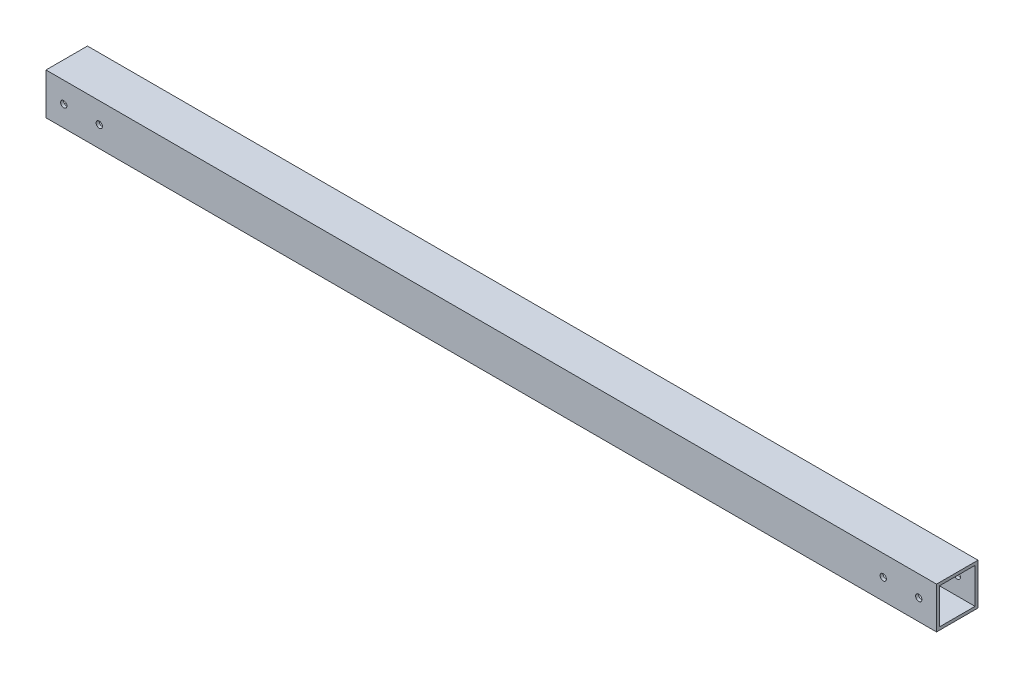
ISO-10303-21;
HEADER;
FILE_DESCRIPTION(('STEP AP214'),'2;1');
FILE_NAME('part.step','',(''),(''),'','','');
FILE_SCHEMA(('AUTOMOTIVE_DESIGN { 1 0 10303 214 1 1 1 1 }'));
ENDSEC;
DATA;
#1=APPLICATION_CONTEXT('core data for automotive mechanical design processes');
#2=APPLICATION_PROTOCOL_DEFINITION('international standard','automotive_design',2000,#1);
#3=PRODUCT_CONTEXT('',#1,'mechanical');
#4=PRODUCT('Part','Part','',(#3));
#5=PRODUCT_RELATED_PRODUCT_CATEGORY('part','',(#4));
#6=PRODUCT_DEFINITION_FORMATION('','',#4);
#7=PRODUCT_DEFINITION_CONTEXT('part definition',#1,'design');
#8=PRODUCT_DEFINITION('design','',#6,#7);
#9=PRODUCT_DEFINITION_SHAPE('','',#8);
#10=(LENGTH_UNIT() NAMED_UNIT(*) SI_UNIT(.MILLI.,.METRE.));
#11=(NAMED_UNIT(*) PLANE_ANGLE_UNIT() SI_UNIT($,.RADIAN.));
#12=(NAMED_UNIT(*) SI_UNIT($,.STERADIAN.) SOLID_ANGLE_UNIT());
#13=UNCERTAINTY_MEASURE_WITH_UNIT(LENGTH_MEASURE(1.E-05),#10,'distance_accuracy_value','');
#14=(GEOMETRIC_REPRESENTATION_CONTEXT(3) GLOBAL_UNCERTAINTY_ASSIGNED_CONTEXT((#13)) GLOBAL_UNIT_ASSIGNED_CONTEXT((#10,
#11,#12)) REPRESENTATION_CONTEXT('',''));
#15=CARTESIAN_POINT('',(0.,0.,0.));
#16=DIRECTION('',(0.,0.,1.));
#17=DIRECTION('',(1.,0.,0.));
#18=AXIS2_PLACEMENT_3D('',#15,#16,#17);
#19=CARTESIAN_POINT('',(954.786,0.,0.));
#20=DIRECTION('',(-1.,0.,0.));
#21=DIRECTION('',(0.,0.,1.));
#22=AXIS2_PLACEMENT_3D('',#19,#20,#21);
#23=PLANE('',#22);
#24=DIRECTION('',(0.,-1.,0.));
#25=VECTOR('',#24,1.);
#26=CARTESIAN_POINT('',(954.786,0.,0.));
#27=LINE('',#26,#25);
#28=CARTESIAN_POINT('',(954.786,44.45,0.));
#29=VERTEX_POINT('',#28);
#30=CARTESIAN_POINT('',(954.786,0.,0.));
#31=VERTEX_POINT('',#30);
#32=EDGE_CURVE('E137',#29,#31,#27,.T.);
#33=ORIENTED_EDGE('',*,*,#32,.T.);
#34=DIRECTION('',(0.,0.,-1.));
#35=VECTOR('',#34,1.);
#36=CARTESIAN_POINT('',(954.786,0.,0.));
#37=LINE('',#36,#35);
#38=CARTESIAN_POINT('',(954.786,0.,-44.45));
#39=VERTEX_POINT('',#38);
#40=EDGE_CURVE('E140',#31,#39,#37,.T.);
#41=ORIENTED_EDGE('',*,*,#40,.T.);
#42=DIRECTION('',(0.,1.,0.));
#43=VECTOR('',#42,1.);
#44=CARTESIAN_POINT('',(954.786,0.,-44.45));
#45=LINE('',#44,#43);
#46=CARTESIAN_POINT('',(954.786,44.45,-44.45));
#47=VERTEX_POINT('',#46);
#48=EDGE_CURVE('E143',#39,#47,#45,.T.);
#49=ORIENTED_EDGE('',*,*,#48,.T.);
#50=DIRECTION('',(0.,0.,1.));
#51=VECTOR('',#50,1.);
#52=CARTESIAN_POINT('',(954.786,44.45,0.));
#53=LINE('',#52,#51);
#54=EDGE_CURVE('E145',#47,#29,#53,.T.);
#55=ORIENTED_EDGE('',*,*,#54,.T.);
#56=EDGE_LOOP('',(#33,#41,#49,#55));
#57=FACE_BOUND('',#56,.T.);
#58=DIRECTION('',(0.,0.,-1.));
#59=VECTOR('',#58,1.);
#60=CARTESIAN_POINT('',(954.786,3.175,-3.175));
#61=LINE('',#60,#59);
#62=CARTESIAN_POINT('',(954.786,3.175,-3.175));
#63=VERTEX_POINT('',#62);
#64=CARTESIAN_POINT('',(954.786,3.175,-41.275));
#65=VERTEX_POINT('',#64);
#66=EDGE_CURVE('E99',#63,#65,#61,.T.);
#67=ORIENTED_EDGE('',*,*,#66,.F.);
#68=DIRECTION('',(0.,-1.,0.));
#69=VECTOR('',#68,1.);
#70=CARTESIAN_POINT('',(954.786,3.175,-3.175));
#71=LINE('',#70,#69);
#72=CARTESIAN_POINT('',(954.786,41.275,-3.175));
#73=VERTEX_POINT('',#72);
#74=EDGE_CURVE('E121',#73,#63,#71,.T.);
#75=ORIENTED_EDGE('',*,*,#74,.F.);
#76=DIRECTION('',(0.,0.,1.));
#77=VECTOR('',#76,1.);
#78=CARTESIAN_POINT('',(954.786,41.275,-3.175));
#79=LINE('',#78,#77);
#80=CARTESIAN_POINT('',(954.786,41.275,-41.275));
#81=VERTEX_POINT('',#80);
#82=EDGE_CURVE('E119',#81,#73,#79,.T.);
#83=ORIENTED_EDGE('',*,*,#82,.F.);
#84=DIRECTION('',(0.,1.,0.));
#85=VECTOR('',#84,1.);
#86=CARTESIAN_POINT('',(954.786,3.175,-41.275));
#87=LINE('',#86,#85);
#88=EDGE_CURVE('E107',#65,#81,#87,.T.);
#89=ORIENTED_EDGE('',*,*,#88,.F.);
#90=EDGE_LOOP('',(#67,#75,#83,#89));
#91=FACE_BOUND('',#90,.T.);
#92=ADVANCED_FACE('F33',(#57,#91),#23,.F.);
#93=CARTESIAN_POINT('',(0.,0.,0.));
#94=DIRECTION('',(-1.,0.,0.));
#95=DIRECTION('',(0.,0.,1.));
#96=AXIS2_PLACEMENT_3D('',#93,#94,#95);
#97=PLANE('',#96);
#98=DIRECTION('',(0.,-1.,0.));
#99=VECTOR('',#98,1.);
#100=CARTESIAN_POINT('',(0.,0.,0.));
#101=LINE('',#100,#99);
#102=CARTESIAN_POINT('',(0.,44.45,0.));
#103=VERTEX_POINT('',#102);
#104=CARTESIAN_POINT('',(0.,0.,0.));
#105=VERTEX_POINT('',#104);
#106=EDGE_CURVE('E115',#103,#105,#101,.T.);
#107=ORIENTED_EDGE('',*,*,#106,.F.);
#108=DIRECTION('',(0.,0.,1.));
#109=VECTOR('',#108,1.);
#110=CARTESIAN_POINT('',(0.,44.45,0.));
#111=LINE('',#110,#109);
#112=CARTESIAN_POINT('',(0.,44.45,-44.45));
#113=VERTEX_POINT('',#112);
#114=EDGE_CURVE('E141',#113,#103,#111,.T.);
#115=ORIENTED_EDGE('',*,*,#114,.F.);
#116=DIRECTION('',(0.,1.,0.));
#117=VECTOR('',#116,1.);
#118=CARTESIAN_POINT('',(0.,0.,-44.45));
#119=LINE('',#118,#117);
#120=CARTESIAN_POINT('',(0.,0.,-44.45));
#121=VERTEX_POINT('',#120);
#122=EDGE_CURVE('E152',#121,#113,#119,.T.);
#123=ORIENTED_EDGE('',*,*,#122,.F.);
#124=DIRECTION('',(0.,0.,-1.));
#125=VECTOR('',#124,1.);
#126=CARTESIAN_POINT('',(0.,0.,0.));
#127=LINE('',#126,#125);
#128=EDGE_CURVE('E150',#105,#121,#127,.T.);
#129=ORIENTED_EDGE('',*,*,#128,.F.);
#130=EDGE_LOOP('',(#107,#115,#123,#129));
#131=FACE_BOUND('',#130,.T.);
#132=DIRECTION('',(0.,-1.,0.));
#133=VECTOR('',#132,1.);
#134=CARTESIAN_POINT('',(0.,3.175,-3.175));
#135=LINE('',#134,#133);
#136=CARTESIAN_POINT('',(0.,41.275,-3.175));
#137=VERTEX_POINT('',#136);
#138=CARTESIAN_POINT('',(0.,3.175,-3.175));
#139=VERTEX_POINT('',#138);
#140=EDGE_CURVE('E108',#137,#139,#135,.T.);
#141=ORIENTED_EDGE('',*,*,#140,.T.);
#142=DIRECTION('',(0.,0.,-1.));
#143=VECTOR('',#142,1.);
#144=CARTESIAN_POINT('',(0.,3.175,-3.175));
#145=LINE('',#144,#143);
#146=CARTESIAN_POINT('',(0.,3.175,-41.275));
#147=VERTEX_POINT('',#146);
#148=EDGE_CURVE('E57',#139,#147,#145,.T.);
#149=ORIENTED_EDGE('',*,*,#148,.T.);
#150=DIRECTION('',(0.,1.,0.));
#151=VECTOR('',#150,1.);
#152=CARTESIAN_POINT('',(0.,3.175,-41.275));
#153=LINE('',#152,#151);
#154=CARTESIAN_POINT('',(0.,41.275,-41.275));
#155=VERTEX_POINT('',#154);
#156=EDGE_CURVE('E114',#147,#155,#153,.T.);
#157=ORIENTED_EDGE('',*,*,#156,.T.);
#158=DIRECTION('',(0.,0.,1.));
#159=VECTOR('',#158,1.);
#160=CARTESIAN_POINT('',(0.,41.275,-3.175));
#161=LINE('',#160,#159);
#162=EDGE_CURVE('E129',#155,#137,#161,.T.);
#163=ORIENTED_EDGE('',*,*,#162,.T.);
#164=EDGE_LOOP('',(#141,#149,#157,#163));
#165=FACE_BOUND('',#164,.T.);
#166=ADVANCED_FACE('F171',(#131,#165),#97,.T.);
#167=CARTESIAN_POINT('',(954.786,0.,0.));
#168=DIRECTION('',(0.,0.,-1.));
#169=DIRECTION('',(-1.,0.,0.));
#170=AXIS2_PLACEMENT_3D('',#167,#168,#169);
#171=PLANE('',#170);
#172=CARTESIAN_POINT('',(19.05,22.225,0.));
#173=DIRECTION('',(0.,0.,1.));
#174=DIRECTION('',(1.,0.,0.));
#175=AXIS2_PLACEMENT_3D('',#172,#173,#174);
#176=CIRCLE('',#175,3.37819999999999);
#177=CARTESIAN_POINT('',(22.4282,22.225,0.));
#178=VERTEX_POINT('',#177);
#179=EDGE_CURVE('E250',#178,#178,#176,.T.);
#180=ORIENTED_EDGE('',*,*,#179,.F.);
#181=EDGE_LOOP('',(#180));
#182=FACE_BOUND('',#181,.T.);
#183=CARTESIAN_POINT('',(57.15,22.225,0.));
#184=DIRECTION('',(0.,0.,1.));
#185=DIRECTION('',(1.,0.,0.));
#186=AXIS2_PLACEMENT_3D('',#183,#184,#185);
#187=CIRCLE('',#186,3.3782);
#188=CARTESIAN_POINT('',(60.5282,22.225,0.));
#189=VERTEX_POINT('',#188);
#190=EDGE_CURVE('E258',#189,#189,#187,.T.);
#191=ORIENTED_EDGE('',*,*,#190,.F.);
#192=EDGE_LOOP('',(#191));
#193=FACE_BOUND('',#192,.T.);
#194=CARTESIAN_POINT('',(935.736,22.225,0.));
#195=DIRECTION('',(0.,0.,1.));
#196=DIRECTION('',(1.,0.,0.));
#197=AXIS2_PLACEMENT_3D('',#194,#195,#196);
#198=CIRCLE('',#197,3.3782);
#199=CARTESIAN_POINT('',(939.1142,22.225,0.));
#200=VERTEX_POINT('',#199);
#201=EDGE_CURVE('E270',#200,#200,#198,.T.);
#202=ORIENTED_EDGE('',*,*,#201,.F.);
#203=EDGE_LOOP('',(#202));
#204=FACE_BOUND('',#203,.T.);
#205=CARTESIAN_POINT('',(897.636,22.225,0.));
#206=DIRECTION('',(0.,0.,1.));
#207=DIRECTION('',(1.,0.,0.));
#208=AXIS2_PLACEMENT_3D('',#205,#206,#207);
#209=CIRCLE('',#208,3.3782);
#210=CARTESIAN_POINT('',(901.0142,22.225,0.));
#211=VERTEX_POINT('',#210);
#212=EDGE_CURVE('E282',#211,#211,#209,.T.);
#213=ORIENTED_EDGE('',*,*,#212,.F.);
#214=EDGE_LOOP('',(#213));
#215=FACE_BOUND('',#214,.T.);
#216=ORIENTED_EDGE('',*,*,#106,.T.);
#217=DIRECTION('',(-1.,0.,0.));
#218=VECTOR('',#217,1.);
#219=CARTESIAN_POINT('',(954.786,0.,0.));
#220=LINE('',#219,#218);
#221=EDGE_CURVE('E11',#31,#105,#220,.T.);
#222=ORIENTED_EDGE('',*,*,#221,.F.);
#223=ORIENTED_EDGE('',*,*,#32,.F.);
#224=DIRECTION('',(-1.,0.,0.));
#225=VECTOR('',#224,1.);
#226=CARTESIAN_POINT('',(954.786,44.45,0.));
#227=LINE('',#226,#225);
#228=EDGE_CURVE('E147',#29,#103,#227,.T.);
#229=ORIENTED_EDGE('',*,*,#228,.T.);
#230=EDGE_LOOP('',(#216,#222,#223,#229));
#231=FACE_BOUND('',#230,.T.);
#232=ADVANCED_FACE('F35',(#182,#193,#204,#215,#231),#171,.F.);
#233=CARTESIAN_POINT('',(954.786,0.,0.));
#234=DIRECTION('',(0.,1.,0.));
#235=DIRECTION('',(0.,0.,1.));
#236=AXIS2_PLACEMENT_3D('',#233,#234,#235);
#237=PLANE('',#236);
#238=ORIENTED_EDGE('',*,*,#128,.T.);
#239=DIRECTION('',(-1.,0.,0.));
#240=VECTOR('',#239,1.);
#241=CARTESIAN_POINT('',(954.786,0.,-44.45));
#242=LINE('',#241,#240);
#243=EDGE_CURVE('E42',#39,#121,#242,.T.);
#244=ORIENTED_EDGE('',*,*,#243,.F.);
#245=ORIENTED_EDGE('',*,*,#40,.F.);
#246=ORIENTED_EDGE('',*,*,#221,.T.);
#247=EDGE_LOOP('',(#238,#244,#245,#246));
#248=FACE_BOUND('',#247,.T.);
#249=ADVANCED_FACE('F181',(#248),#237,.F.);
#250=CARTESIAN_POINT('',(954.786,0.,-44.45));
#251=DIRECTION('',(0.,0.,1.));
#252=DIRECTION('',(1.,0.,0.));
#253=AXIS2_PLACEMENT_3D('',#250,#251,#252);
#254=PLANE('',#253);
#255=CARTESIAN_POINT('',(19.05,22.225,-44.45));
#256=DIRECTION('',(0.,0.,1.));
#257=DIRECTION('',(1.,0.,0.));
#258=AXIS2_PLACEMENT_3D('',#255,#256,#257);
#259=CIRCLE('',#258,3.37819999999999);
#260=CARTESIAN_POINT('',(22.4282,22.225,-44.45));
#261=VERTEX_POINT('',#260);
#262=EDGE_CURVE('E249',#261,#261,#259,.T.);
#263=ORIENTED_EDGE('',*,*,#262,.T.);
#264=EDGE_LOOP('',(#263));
#265=FACE_BOUND('',#264,.T.);
#266=CARTESIAN_POINT('',(57.15,22.225,-44.45));
#267=DIRECTION('',(0.,0.,1.));
#268=DIRECTION('',(1.,0.,0.));
#269=AXIS2_PLACEMENT_3D('',#266,#267,#268);
#270=CIRCLE('',#269,3.37819999999999);
#271=CARTESIAN_POINT('',(60.5282,22.225,-44.45));
#272=VERTEX_POINT('',#271);
#273=EDGE_CURVE('E261',#272,#272,#270,.T.);
#274=ORIENTED_EDGE('',*,*,#273,.T.);
#275=EDGE_LOOP('',(#274));
#276=FACE_BOUND('',#275,.T.);
#277=CARTESIAN_POINT('',(935.736,22.225,-44.45));
#278=DIRECTION('',(0.,0.,1.));
#279=DIRECTION('',(1.,0.,0.));
#280=AXIS2_PLACEMENT_3D('',#277,#278,#279);
#281=CIRCLE('',#280,3.3782);
#282=CARTESIAN_POINT('',(939.1142,22.225,-44.45));
#283=VERTEX_POINT('',#282);
#284=EDGE_CURVE('E273',#283,#283,#281,.T.);
#285=ORIENTED_EDGE('',*,*,#284,.T.);
#286=EDGE_LOOP('',(#285));
#287=FACE_BOUND('',#286,.T.);
#288=CARTESIAN_POINT('',(897.636,22.225,-44.45));
#289=DIRECTION('',(0.,0.,1.));
#290=DIRECTION('',(1.,0.,0.));
#291=AXIS2_PLACEMENT_3D('',#288,#289,#290);
#292=CIRCLE('',#291,3.3782);
#293=CARTESIAN_POINT('',(901.0142,22.225,-44.45));
#294=VERTEX_POINT('',#293);
#295=EDGE_CURVE('E285',#294,#294,#292,.T.);
#296=ORIENTED_EDGE('',*,*,#295,.T.);
#297=EDGE_LOOP('',(#296));
#298=FACE_BOUND('',#297,.T.);
#299=ORIENTED_EDGE('',*,*,#122,.T.);
#300=DIRECTION('',(-1.,0.,0.));
#301=VECTOR('',#300,1.);
#302=CARTESIAN_POINT('',(954.786,44.45,-44.45));
#303=LINE('',#302,#301);
#304=EDGE_CURVE('E157',#47,#113,#303,.T.);
#305=ORIENTED_EDGE('',*,*,#304,.F.);
#306=ORIENTED_EDGE('',*,*,#48,.F.);
#307=ORIENTED_EDGE('',*,*,#243,.T.);
#308=EDGE_LOOP('',(#299,#305,#306,#307));
#309=FACE_BOUND('',#308,.T.);
#310=ADVANCED_FACE('F165',(#265,#276,#287,#298,#309),#254,.F.);
#311=CARTESIAN_POINT('',(954.786,44.45,0.));
#312=DIRECTION('',(0.,-1.,0.));
#313=DIRECTION('',(0.,0.,-1.));
#314=AXIS2_PLACEMENT_3D('',#311,#312,#313);
#315=PLANE('',#314);
#316=ORIENTED_EDGE('',*,*,#114,.T.);
#317=ORIENTED_EDGE('',*,*,#228,.F.);
#318=ORIENTED_EDGE('',*,*,#54,.F.);
#319=ORIENTED_EDGE('',*,*,#304,.T.);
#320=EDGE_LOOP('',(#316,#317,#318,#319));
#321=FACE_BOUND('',#320,.T.);
#322=ADVANCED_FACE('F175',(#321),#315,.F.);
#323=CARTESIAN_POINT('',(954.786,3.175,-3.175));
#324=DIRECTION('',(0.,1.,0.));
#325=DIRECTION('',(0.,0.,1.));
#326=AXIS2_PLACEMENT_3D('',#323,#324,#325);
#327=PLANE('',#326);
#328=ORIENTED_EDGE('',*,*,#148,.F.);
#329=DIRECTION('',(-1.,0.,0.));
#330=VECTOR('',#329,1.);
#331=CARTESIAN_POINT('',(954.786,3.175,-3.175));
#332=LINE('',#331,#330);
#333=EDGE_CURVE('E103',#63,#139,#332,.T.);
#334=ORIENTED_EDGE('',*,*,#333,.F.);
#335=ORIENTED_EDGE('',*,*,#66,.T.);
#336=DIRECTION('',(-1.,0.,0.));
#337=VECTOR('',#336,1.);
#338=CARTESIAN_POINT('',(954.786,3.175,-41.275));
#339=LINE('',#338,#337);
#340=EDGE_CURVE('E102',#65,#147,#339,.T.);
#341=ORIENTED_EDGE('',*,*,#340,.T.);
#342=EDGE_LOOP('',(#328,#334,#335,#341));
#343=FACE_BOUND('',#342,.T.);
#344=ADVANCED_FACE('F101',(#343),#327,.T.);
#345=CARTESIAN_POINT('',(954.786,3.175,-41.275));
#346=DIRECTION('',(0.,0.,1.));
#347=DIRECTION('',(0.,-1.,0.));
#348=AXIS2_PLACEMENT_3D('',#345,#346,#347);
#349=PLANE('',#348);
#350=CARTESIAN_POINT('',(19.05,22.225,-41.275));
#351=DIRECTION('',(0.,0.,1.));
#352=DIRECTION('',(0.,-1.,0.));
#353=AXIS2_PLACEMENT_3D('',#350,#351,#352);
#354=CIRCLE('',#353,3.37819999999999);
#355=CARTESIAN_POINT('',(19.05,18.8468,-41.275));
#356=VERTEX_POINT('',#355);
#357=EDGE_CURVE('E37',#356,#356,#354,.T.);
#358=ORIENTED_EDGE('',*,*,#357,.F.);
#359=EDGE_LOOP('',(#358));
#360=FACE_BOUND('',#359,.T.);
#361=CARTESIAN_POINT('',(57.15,22.225,-41.275));
#362=DIRECTION('',(0.,0.,1.));
#363=DIRECTION('',(0.,-1.,0.));
#364=AXIS2_PLACEMENT_3D('',#361,#362,#363);
#365=CIRCLE('',#364,3.37819999999999);
#366=CARTESIAN_POINT('',(57.15,18.8468,-41.275));
#367=VERTEX_POINT('',#366);
#368=EDGE_CURVE('E264',#367,#367,#365,.T.);
#369=ORIENTED_EDGE('',*,*,#368,.F.);
#370=EDGE_LOOP('',(#369));
#371=FACE_BOUND('',#370,.T.);
#372=CARTESIAN_POINT('',(935.736,22.225,-41.275));
#373=DIRECTION('',(0.,0.,1.));
#374=DIRECTION('',(0.,-1.,0.));
#375=AXIS2_PLACEMENT_3D('',#372,#373,#374);
#376=CIRCLE('',#375,3.3782);
#377=CARTESIAN_POINT('',(935.736,18.8468,-41.275));
#378=VERTEX_POINT('',#377);
#379=EDGE_CURVE('E276',#378,#378,#376,.T.);
#380=ORIENTED_EDGE('',*,*,#379,.F.);
#381=EDGE_LOOP('',(#380));
#382=FACE_BOUND('',#381,.T.);
#383=CARTESIAN_POINT('',(897.636,22.225,-41.275));
#384=DIRECTION('',(0.,0.,1.));
#385=DIRECTION('',(0.,-1.,0.));
#386=AXIS2_PLACEMENT_3D('',#383,#384,#385);
#387=CIRCLE('',#386,3.3782);
#388=CARTESIAN_POINT('',(897.636,18.8468,-41.275));
#389=VERTEX_POINT('',#388);
#390=EDGE_CURVE('E288',#389,#389,#387,.T.);
#391=ORIENTED_EDGE('',*,*,#390,.F.);
#392=EDGE_LOOP('',(#391));
#393=FACE_BOUND('',#392,.T.);
#394=ORIENTED_EDGE('',*,*,#156,.F.);
#395=ORIENTED_EDGE('',*,*,#340,.F.);
#396=ORIENTED_EDGE('',*,*,#88,.T.);
#397=DIRECTION('',(-1.,0.,0.));
#398=VECTOR('',#397,1.);
#399=CARTESIAN_POINT('',(954.786,41.275,-41.275));
#400=LINE('',#399,#398);
#401=EDGE_CURVE('E116',#81,#155,#400,.T.);
#402=ORIENTED_EDGE('',*,*,#401,.T.);
#403=EDGE_LOOP('',(#394,#395,#396,#402));
#404=FACE_BOUND('',#403,.T.);
#405=ADVANCED_FACE('F111',(#360,#371,#382,#393,#404),#349,.T.);
#406=CARTESIAN_POINT('',(954.786,41.275,-3.175));
#407=DIRECTION('',(0.,-1.,0.));
#408=DIRECTION('',(0.,0.,-1.));
#409=AXIS2_PLACEMENT_3D('',#406,#407,#408);
#410=PLANE('',#409);
#411=ORIENTED_EDGE('',*,*,#162,.F.);
#412=ORIENTED_EDGE('',*,*,#401,.F.);
#413=ORIENTED_EDGE('',*,*,#82,.T.);
#414=DIRECTION('',(-1.,0.,0.));
#415=VECTOR('',#414,1.);
#416=CARTESIAN_POINT('',(954.786,41.275,-3.175));
#417=LINE('',#416,#415);
#418=EDGE_CURVE('E49',#73,#137,#417,.T.);
#419=ORIENTED_EDGE('',*,*,#418,.T.);
#420=EDGE_LOOP('',(#411,#412,#413,#419));
#421=FACE_BOUND('',#420,.T.);
#422=ADVANCED_FACE('F206',(#421),#410,.T.);
#423=CARTESIAN_POINT('',(954.786,3.175,-3.175));
#424=DIRECTION('',(0.,0.,-1.));
#425=DIRECTION('',(-1.,0.,0.));
#426=AXIS2_PLACEMENT_3D('',#423,#424,#425);
#427=PLANE('',#426);
#428=CARTESIAN_POINT('',(19.05,22.225,-3.175));
#429=DIRECTION('',(0.,0.,-1.));
#430=DIRECTION('',(-1.,0.,0.));
#431=AXIS2_PLACEMENT_3D('',#428,#429,#430);
#432=CIRCLE('',#431,3.37819999999999);
#433=CARTESIAN_POINT('',(15.6718,22.225,-3.175));
#434=VERTEX_POINT('',#433);
#435=EDGE_CURVE('E252',#434,#434,#432,.T.);
#436=ORIENTED_EDGE('',*,*,#435,.F.);
#437=EDGE_LOOP('',(#436));
#438=FACE_BOUND('',#437,.T.);
#439=CARTESIAN_POINT('',(57.15,22.225,-3.175));
#440=DIRECTION('',(0.,0.,-1.));
#441=DIRECTION('',(-1.,0.,0.));
#442=AXIS2_PLACEMENT_3D('',#439,#440,#441);
#443=CIRCLE('',#442,3.37819999999999);
#444=CARTESIAN_POINT('',(53.7718,22.225,-3.175));
#445=VERTEX_POINT('',#444);
#446=EDGE_CURVE('E267',#445,#445,#443,.T.);
#447=ORIENTED_EDGE('',*,*,#446,.F.);
#448=EDGE_LOOP('',(#447));
#449=FACE_BOUND('',#448,.T.);
#450=CARTESIAN_POINT('',(935.736,22.225,-3.175));
#451=DIRECTION('',(0.,0.,-1.));
#452=DIRECTION('',(-1.,0.,0.));
#453=AXIS2_PLACEMENT_3D('',#450,#451,#452);
#454=CIRCLE('',#453,3.3782);
#455=CARTESIAN_POINT('',(932.3578,22.225,-3.175));
#456=VERTEX_POINT('',#455);
#457=EDGE_CURVE('E279',#456,#456,#454,.T.);
#458=ORIENTED_EDGE('',*,*,#457,.F.);
#459=EDGE_LOOP('',(#458));
#460=FACE_BOUND('',#459,.T.);
#461=CARTESIAN_POINT('',(897.636,22.225,-3.175));
#462=DIRECTION('',(0.,0.,-1.));
#463=DIRECTION('',(-1.,0.,0.));
#464=AXIS2_PLACEMENT_3D('',#461,#462,#463);
#465=CIRCLE('',#464,3.3782);
#466=CARTESIAN_POINT('',(894.2578,22.225,-3.175));
#467=VERTEX_POINT('',#466);
#468=EDGE_CURVE('E127',#467,#467,#465,.T.);
#469=ORIENTED_EDGE('',*,*,#468,.F.);
#470=EDGE_LOOP('',(#469));
#471=FACE_BOUND('',#470,.T.);
#472=ORIENTED_EDGE('',*,*,#140,.F.);
#473=ORIENTED_EDGE('',*,*,#418,.F.);
#474=ORIENTED_EDGE('',*,*,#74,.T.);
#475=ORIENTED_EDGE('',*,*,#333,.T.);
#476=EDGE_LOOP('',(#472,#473,#474,#475));
#477=FACE_BOUND('',#476,.T.);
#478=ADVANCED_FACE('F211',(#438,#449,#460,#471,#477),#427,.T.);
#479=CARTESIAN_POINT('',(897.636,22.225,0.));
#480=DIRECTION('',(0.,0.,1.));
#481=DIRECTION('',(1.,0.,0.));
#482=AXIS2_PLACEMENT_3D('',#479,#480,#481);
#483=CYLINDRICAL_SURFACE('',#482,3.3782);
#484=ORIENTED_EDGE('',*,*,#390,.T.);
#485=EDGE_LOOP('',(#484));
#486=FACE_BOUND('',#485,.T.);
#487=ORIENTED_EDGE('',*,*,#295,.F.);
#488=EDGE_LOOP('',(#487));
#489=FACE_BOUND('',#488,.T.);
#490=ADVANCED_FACE('F219',(#486,#489),#483,.F.);
#491=ORIENTED_EDGE('',*,*,#468,.T.);
#492=EDGE_LOOP('',(#491));
#493=FACE_BOUND('',#492,.T.);
#494=ORIENTED_EDGE('',*,*,#212,.T.);
#495=EDGE_LOOP('',(#494));
#496=FACE_BOUND('',#495,.T.);
#497=ADVANCED_FACE('F223',(#493,#496),#483,.F.);
#498=CARTESIAN_POINT('',(935.736,22.225,0.));
#499=DIRECTION('',(0.,0.,1.));
#500=DIRECTION('',(1.,0.,0.));
#501=AXIS2_PLACEMENT_3D('',#498,#499,#500);
#502=CYLINDRICAL_SURFACE('',#501,3.3782);
#503=ORIENTED_EDGE('',*,*,#379,.T.);
#504=EDGE_LOOP('',(#503));
#505=FACE_BOUND('',#504,.T.);
#506=ORIENTED_EDGE('',*,*,#284,.F.);
#507=EDGE_LOOP('',(#506));
#508=FACE_BOUND('',#507,.T.);
#509=ADVANCED_FACE('F225',(#505,#508),#502,.F.);
#510=ORIENTED_EDGE('',*,*,#457,.T.);
#511=EDGE_LOOP('',(#510));
#512=FACE_BOUND('',#511,.T.);
#513=ORIENTED_EDGE('',*,*,#201,.T.);
#514=EDGE_LOOP('',(#513));
#515=FACE_BOUND('',#514,.T.);
#516=ADVANCED_FACE('F228',(#512,#515),#502,.F.);
#517=CARTESIAN_POINT('',(57.15,22.225,0.));
#518=DIRECTION('',(0.,0.,1.));
#519=DIRECTION('',(1.,0.,0.));
#520=AXIS2_PLACEMENT_3D('',#517,#518,#519);
#521=CYLINDRICAL_SURFACE('',#520,3.37819999999999);
#522=ORIENTED_EDGE('',*,*,#368,.T.);
#523=EDGE_LOOP('',(#522));
#524=FACE_BOUND('',#523,.T.);
#525=ORIENTED_EDGE('',*,*,#273,.F.);
#526=EDGE_LOOP('',(#525));
#527=FACE_BOUND('',#526,.T.);
#528=ADVANCED_FACE('F230',(#524,#527),#521,.F.);
#529=ORIENTED_EDGE('',*,*,#446,.T.);
#530=EDGE_LOOP('',(#529));
#531=FACE_BOUND('',#530,.T.);
#532=ORIENTED_EDGE('',*,*,#190,.T.);
#533=EDGE_LOOP('',(#532));
#534=FACE_BOUND('',#533,.T.);
#535=ADVANCED_FACE('F233',(#531,#534),#521,.F.);
#536=CARTESIAN_POINT('',(19.05,22.225,0.));
#537=DIRECTION('',(0.,0.,1.));
#538=DIRECTION('',(1.,0.,0.));
#539=AXIS2_PLACEMENT_3D('',#536,#537,#538);
#540=CYLINDRICAL_SURFACE('',#539,3.37819999999999);
#541=ORIENTED_EDGE('',*,*,#357,.T.);
#542=EDGE_LOOP('',(#541));
#543=FACE_BOUND('',#542,.T.);
#544=ORIENTED_EDGE('',*,*,#262,.F.);
#545=EDGE_LOOP('',(#544));
#546=FACE_BOUND('',#545,.T.);
#547=ADVANCED_FACE('F235',(#543,#546),#540,.F.);
#548=ORIENTED_EDGE('',*,*,#435,.T.);
#549=EDGE_LOOP('',(#548));
#550=FACE_BOUND('',#549,.T.);
#551=ORIENTED_EDGE('',*,*,#179,.T.);
#552=EDGE_LOOP('',(#551));
#553=FACE_BOUND('',#552,.T.);
#554=ADVANCED_FACE('F237',(#550,#553),#540,.F.);
#555=CLOSED_SHELL('',(#92,#166,#232,#249,#310,#322,#344,#405,#422,#478,#490,#497,#509,#516,#528,
#535,#547,#554));
#556=MANIFOLD_SOLID_BREP('B2',#555);
#557=ADVANCED_BREP_SHAPE_REPRESENTATION('',(#18,#556),#14);
#558=SHAPE_DEFINITION_REPRESENTATION(#9,#557);
ENDSEC;
END-ISO-10303-21;
